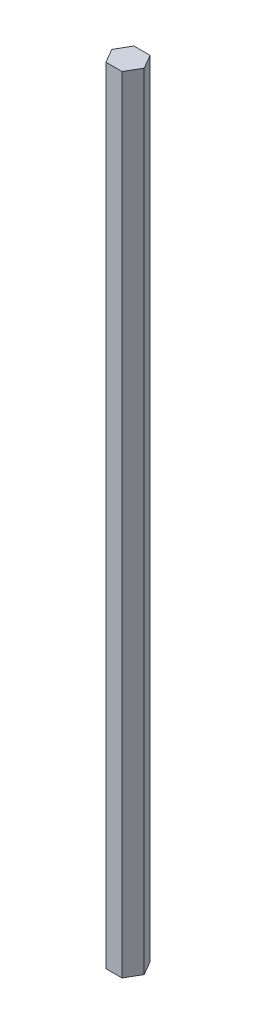
ISO-10303-21;
HEADER;
FILE_DESCRIPTION(('STEP AP214'),'2;1');
FILE_NAME('part.step','',(''),(''),'','','');
FILE_SCHEMA(('AUTOMOTIVE_DESIGN { 1 0 10303 214 1 1 1 1 }'));
ENDSEC;
DATA;
#1=APPLICATION_CONTEXT('core data for automotive mechanical design processes');
#2=APPLICATION_PROTOCOL_DEFINITION('international standard','automotive_design',2000,#1);
#3=PRODUCT_CONTEXT('',#1,'mechanical');
#4=PRODUCT('Part','Part','',(#3));
#5=PRODUCT_RELATED_PRODUCT_CATEGORY('part','',(#4));
#6=PRODUCT_DEFINITION_FORMATION('','',#4);
#7=PRODUCT_DEFINITION_CONTEXT('part definition',#1,'design');
#8=PRODUCT_DEFINITION('design','',#6,#7);
#9=PRODUCT_DEFINITION_SHAPE('','',#8);
#10=(LENGTH_UNIT() NAMED_UNIT(*) SI_UNIT(.MILLI.,.METRE.));
#11=(NAMED_UNIT(*) PLANE_ANGLE_UNIT() SI_UNIT($,.RADIAN.));
#12=(NAMED_UNIT(*) SI_UNIT($,.STERADIAN.) SOLID_ANGLE_UNIT());
#13=UNCERTAINTY_MEASURE_WITH_UNIT(LENGTH_MEASURE(1.E-05),#10,'distance_accuracy_value','');
#14=(GEOMETRIC_REPRESENTATION_CONTEXT(3) GLOBAL_UNCERTAINTY_ASSIGNED_CONTEXT((#13)) GLOBAL_UNIT_ASSIGNED_CONTEXT((#10,
#11,#12)) REPRESENTATION_CONTEXT('',''));
#15=CARTESIAN_POINT('',(0.,0.,0.));
#16=DIRECTION('',(0.,0.,1.));
#17=DIRECTION('',(1.,0.,0.));
#18=AXIS2_PLACEMENT_3D('',#15,#16,#17);
#19=CARTESIAN_POINT('',(7.33234841870824,355.6,0.));
#20=DIRECTION('',(-0.866025403784439,0.,0.5));
#21=DIRECTION('',(0.5,0.,0.866025403784439));
#22=AXIS2_PLACEMENT_3D('',#19,#20,#21);
#23=PLANE('',#22);
#24=DIRECTION('',(-0.5,0.,-0.866025403784439));
#25=VECTOR('',#24,1.);
#26=CARTESIAN_POINT('',(7.33234841870824,0.,0.));
#27=LINE('',#26,#25);
#28=CARTESIAN_POINT('',(7.33234841870824,0.,0.));
#29=VERTEX_POINT('',#28);
#30=CARTESIAN_POINT('',(3.66617420935412,0.,-6.35));
#31=VERTEX_POINT('',#30);
#32=EDGE_CURVE('E134',#29,#31,#27,.T.);
#33=ORIENTED_EDGE('',*,*,#32,.T.);
#34=DIRECTION('',(0.,-1.,0.));
#35=VECTOR('',#34,1.);
#36=CARTESIAN_POINT('',(3.66617420935412,355.6,-6.35));
#37=LINE('',#36,#35);
#38=CARTESIAN_POINT('',(3.66617420935412,355.6,-6.35));
#39=VERTEX_POINT('',#38);
#40=EDGE_CURVE('E11',#39,#31,#37,.T.);
#41=ORIENTED_EDGE('',*,*,#40,.F.);
#42=DIRECTION('',(-0.5,0.,-0.866025403784439));
#43=VECTOR('',#42,1.);
#44=CARTESIAN_POINT('',(7.33234841870824,355.6,0.));
#45=LINE('',#44,#43);
#46=CARTESIAN_POINT('',(7.33234841870824,355.6,0.));
#47=VERTEX_POINT('',#46);
#48=EDGE_CURVE('E150',#47,#39,#45,.T.);
#49=ORIENTED_EDGE('',*,*,#48,.F.);
#50=DIRECTION('',(0.,-1.,0.));
#51=VECTOR('',#50,1.);
#52=CARTESIAN_POINT('',(7.33234841870824,355.6,0.));
#53=LINE('',#52,#51);
#54=EDGE_CURVE('E130',#47,#29,#53,.T.);
#55=ORIENTED_EDGE('',*,*,#54,.T.);
#56=EDGE_LOOP('',(#33,#41,#49,#55));
#57=FACE_BOUND('',#56,.T.);
#58=ADVANCED_FACE('F45',(#57),#23,.F.);
#59=CARTESIAN_POINT('',(3.66617420935412,355.6,-6.35));
#60=DIRECTION('',(0.,0.,1.));
#61=DIRECTION('',(1.,0.,0.));
#62=AXIS2_PLACEMENT_3D('',#59,#60,#61);
#63=PLANE('',#62);
#64=DIRECTION('',(-1.,0.,0.));
#65=VECTOR('',#64,1.);
#66=CARTESIAN_POINT('',(3.66617420935412,0.,-6.35));
#67=LINE('',#66,#65);
#68=CARTESIAN_POINT('',(-3.66617420935412,0.,-6.35));
#69=VERTEX_POINT('',#68);
#70=EDGE_CURVE('E138',#31,#69,#67,.T.);
#71=ORIENTED_EDGE('',*,*,#70,.T.);
#72=DIRECTION('',(0.,-1.,0.));
#73=VECTOR('',#72,1.);
#74=CARTESIAN_POINT('',(-3.66617420935412,355.6,-6.35));
#75=LINE('',#74,#73);
#76=CARTESIAN_POINT('',(-3.66617420935412,355.6,-6.35));
#77=VERTEX_POINT('',#76);
#78=EDGE_CURVE('E54',#77,#69,#75,.T.);
#79=ORIENTED_EDGE('',*,*,#78,.F.);
#80=DIRECTION('',(-1.,0.,0.));
#81=VECTOR('',#80,1.);
#82=CARTESIAN_POINT('',(3.66617420935412,355.6,-6.35));
#83=LINE('',#82,#81);
#84=EDGE_CURVE('E99',#39,#77,#83,.T.);
#85=ORIENTED_EDGE('',*,*,#84,.F.);
#86=ORIENTED_EDGE('',*,*,#40,.T.);
#87=EDGE_LOOP('',(#71,#79,#85,#86));
#88=FACE_BOUND('',#87,.T.);
#89=ADVANCED_FACE('F178',(#88),#63,.F.);
#90=CARTESIAN_POINT('',(-3.66617420935412,355.6,-6.35));
#91=DIRECTION('',(0.866025403784439,0.,0.5));
#92=DIRECTION('',(0.5,0.,-0.866025403784439));
#93=AXIS2_PLACEMENT_3D('',#90,#91,#92);
#94=PLANE('',#93);
#95=DIRECTION('',(-0.5,0.,0.866025403784439));
#96=VECTOR('',#95,1.);
#97=CARTESIAN_POINT('',(-3.66617420935412,0.,-6.35));
#98=LINE('',#97,#96);
#99=CARTESIAN_POINT('',(-7.33234841870824,0.,0.));
#100=VERTEX_POINT('',#99);
#101=EDGE_CURVE('E141',#69,#100,#98,.T.);
#102=ORIENTED_EDGE('',*,*,#101,.T.);
#103=DIRECTION('',(0.,-1.,0.));
#104=VECTOR('',#103,1.);
#105=CARTESIAN_POINT('',(-7.33234841870824,355.6,0.));
#106=LINE('',#105,#104);
#107=CARTESIAN_POINT('',(-7.33234841870824,355.6,0.));
#108=VERTEX_POINT('',#107);
#109=EDGE_CURVE('E123',#108,#100,#106,.T.);
#110=ORIENTED_EDGE('',*,*,#109,.F.);
#111=DIRECTION('',(-0.5,0.,0.866025403784439));
#112=VECTOR('',#111,1.);
#113=CARTESIAN_POINT('',(-3.66617420935412,355.6,-6.35));
#114=LINE('',#113,#112);
#115=EDGE_CURVE('E112',#77,#108,#114,.T.);
#116=ORIENTED_EDGE('',*,*,#115,.F.);
#117=ORIENTED_EDGE('',*,*,#78,.T.);
#118=EDGE_LOOP('',(#102,#110,#116,#117));
#119=FACE_BOUND('',#118,.T.);
#120=ADVANCED_FACE('F160',(#119),#94,.F.);
#121=CARTESIAN_POINT('',(-7.33234841870824,355.6,0.));
#122=DIRECTION('',(0.866025403784439,0.,-0.5));
#123=DIRECTION('',(-0.5,0.,-0.866025403784439));
#124=AXIS2_PLACEMENT_3D('',#121,#122,#123);
#125=PLANE('',#124);
#126=DIRECTION('',(0.5,0.,0.866025403784438));
#127=VECTOR('',#126,1.);
#128=CARTESIAN_POINT('',(-7.33234841870824,0.,0.));
#129=LINE('',#128,#127);
#130=CARTESIAN_POINT('',(-3.66617420935412,0.,6.35));
#131=VERTEX_POINT('',#130);
#132=EDGE_CURVE('E121',#100,#131,#129,.T.);
#133=ORIENTED_EDGE('',*,*,#132,.T.);
#134=DIRECTION('',(0.,-1.,0.));
#135=VECTOR('',#134,1.);
#136=CARTESIAN_POINT('',(-3.66617420935412,355.6,6.35));
#137=LINE('',#136,#135);
#138=CARTESIAN_POINT('',(-3.66617420935412,355.6,6.35));
#139=VERTEX_POINT('',#138);
#140=EDGE_CURVE('E118',#139,#131,#137,.T.);
#141=ORIENTED_EDGE('',*,*,#140,.F.);
#142=DIRECTION('',(0.5,0.,0.866025403784438));
#143=VECTOR('',#142,1.);
#144=CARTESIAN_POINT('',(-7.33234841870824,355.6,0.));
#145=LINE('',#144,#143);
#146=EDGE_CURVE('E106',#108,#139,#145,.T.);
#147=ORIENTED_EDGE('',*,*,#146,.F.);
#148=ORIENTED_EDGE('',*,*,#109,.T.);
#149=EDGE_LOOP('',(#133,#141,#147,#148));
#150=FACE_BOUND('',#149,.T.);
#151=ADVANCED_FACE('F119',(#150),#125,.F.);
#152=CARTESIAN_POINT('',(-3.66617420935412,355.6,6.35));
#153=DIRECTION('',(0.,0.,-1.));
#154=DIRECTION('',(-1.,0.,0.));
#155=AXIS2_PLACEMENT_3D('',#152,#153,#154);
#156=PLANE('',#155);
#157=DIRECTION('',(1.,0.,0.));
#158=VECTOR('',#157,1.);
#159=CARTESIAN_POINT('',(-3.66617420935412,0.,6.35));
#160=LINE('',#159,#158);
#161=CARTESIAN_POINT('',(3.66617420935412,0.,6.35));
#162=VERTEX_POINT('',#161);
#163=EDGE_CURVE('E85',#131,#162,#160,.T.);
#164=ORIENTED_EDGE('',*,*,#163,.T.);
#165=DIRECTION('',(0.,-1.,0.));
#166=VECTOR('',#165,1.);
#167=CARTESIAN_POINT('',(3.66617420935412,355.6,6.35));
#168=LINE('',#167,#166);
#169=CARTESIAN_POINT('',(3.66617420935412,355.6,6.35));
#170=VERTEX_POINT('',#169);
#171=EDGE_CURVE('E124',#170,#162,#168,.T.);
#172=ORIENTED_EDGE('',*,*,#171,.F.);
#173=DIRECTION('',(1.,0.,0.));
#174=VECTOR('',#173,1.);
#175=CARTESIAN_POINT('',(-3.66617420935412,355.6,6.35));
#176=LINE('',#175,#174);
#177=EDGE_CURVE('E110',#139,#170,#176,.T.);
#178=ORIENTED_EDGE('',*,*,#177,.F.);
#179=ORIENTED_EDGE('',*,*,#140,.T.);
#180=EDGE_LOOP('',(#164,#172,#178,#179));
#181=FACE_BOUND('',#180,.T.);
#182=ADVANCED_FACE('F126',(#181),#156,.F.);
#183=CARTESIAN_POINT('',(3.66617420935412,355.6,6.35));
#184=DIRECTION('',(-0.866025403784439,0.,-0.5));
#185=DIRECTION('',(-0.5,0.,0.866025403784439));
#186=AXIS2_PLACEMENT_3D('',#183,#184,#185);
#187=PLANE('',#186);
#188=DIRECTION('',(0.5,0.,-0.866025403784439));
#189=VECTOR('',#188,1.);
#190=CARTESIAN_POINT('',(3.66617420935412,0.,6.35));
#191=LINE('',#190,#189);
#192=EDGE_CURVE('E91',#162,#29,#191,.T.);
#193=ORIENTED_EDGE('',*,*,#192,.T.);
#194=ORIENTED_EDGE('',*,*,#54,.F.);
#195=DIRECTION('',(0.5,0.,-0.866025403784439));
#196=VECTOR('',#195,1.);
#197=CARTESIAN_POINT('',(3.66617420935412,355.6,6.35));
#198=LINE('',#197,#196);
#199=EDGE_CURVE('E62',#170,#47,#198,.T.);
#200=ORIENTED_EDGE('',*,*,#199,.F.);
#201=ORIENTED_EDGE('',*,*,#171,.T.);
#202=EDGE_LOOP('',(#193,#194,#200,#201));
#203=FACE_BOUND('',#202,.T.);
#204=ADVANCED_FACE('F167',(#203),#187,.F.);
#205=CARTESIAN_POINT('',(0.,355.6,0.));
#206=DIRECTION('',(0.,1.,0.));
#207=DIRECTION('',(0.,0.,1.));
#208=AXIS2_PLACEMENT_3D('',#205,#206,#207);
#209=PLANE('',#208);
#210=ORIENTED_EDGE('',*,*,#48,.T.);
#211=ORIENTED_EDGE('',*,*,#84,.T.);
#212=ORIENTED_EDGE('',*,*,#115,.T.);
#213=ORIENTED_EDGE('',*,*,#146,.T.);
#214=ORIENTED_EDGE('',*,*,#177,.T.);
#215=ORIENTED_EDGE('',*,*,#199,.T.);
#216=EDGE_LOOP('',(#210,#211,#212,#213,#214,#215));
#217=FACE_BOUND('',#216,.T.);
#218=ADVANCED_FACE('F108',(#217),#209,.T.);
#219=CARTESIAN_POINT('',(0.,0.,0.));
#220=DIRECTION('',(0.,1.,0.));
#221=DIRECTION('',(0.,0.,1.));
#222=AXIS2_PLACEMENT_3D('',#219,#220,#221);
#223=PLANE('',#222);
#224=ORIENTED_EDGE('',*,*,#32,.F.);
#225=ORIENTED_EDGE('',*,*,#192,.F.);
#226=ORIENTED_EDGE('',*,*,#163,.F.);
#227=ORIENTED_EDGE('',*,*,#132,.F.);
#228=ORIENTED_EDGE('',*,*,#101,.F.);
#229=ORIENTED_EDGE('',*,*,#70,.F.);
#230=EDGE_LOOP('',(#224,#225,#226,#227,#228,#229));
#231=FACE_BOUND('',#230,.T.);
#232=ADVANCED_FACE('F163',(#231),#223,.F.);
#233=CLOSED_SHELL('',(#58,#89,#120,#151,#182,#204,#218,#232));
#234=MANIFOLD_SOLID_BREP('B2',#233);
#235=ADVANCED_BREP_SHAPE_REPRESENTATION('',(#18,#234),#14);
#236=SHAPE_DEFINITION_REPRESENTATION(#9,#235);
ENDSEC;
END-ISO-10303-21;
